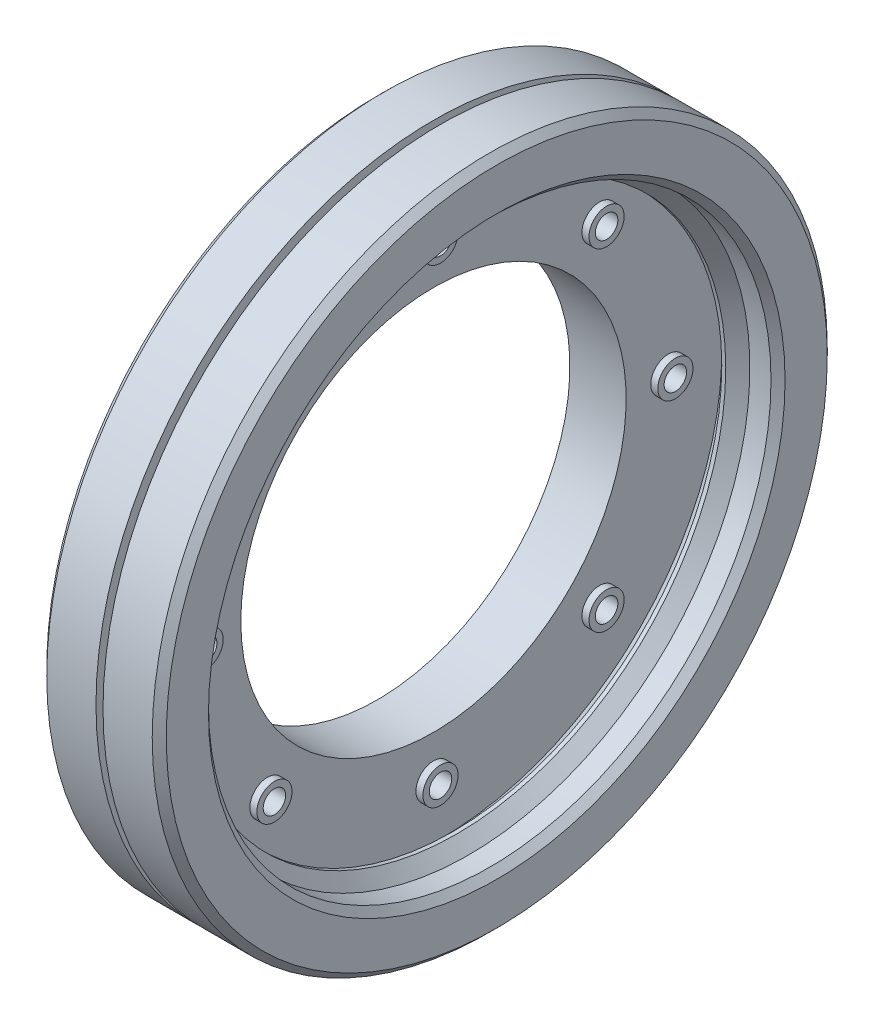
ISO-10303-21;
HEADER;
FILE_DESCRIPTION(('STEP AP214'),'2;1');
FILE_NAME('part.step','',(''),(''),'','','');
FILE_SCHEMA(('AUTOMOTIVE_DESIGN { 1 0 10303 214 1 1 1 1 }'));
ENDSEC;
DATA;
#1=APPLICATION_CONTEXT('core data for automotive mechanical design processes');
#2=APPLICATION_PROTOCOL_DEFINITION('international standard','automotive_design',2000,#1);
#3=PRODUCT_CONTEXT('',#1,'mechanical');
#4=PRODUCT('Part','Part','',(#3));
#5=PRODUCT_RELATED_PRODUCT_CATEGORY('part','',(#4));
#6=PRODUCT_DEFINITION_FORMATION('','',#4);
#7=PRODUCT_DEFINITION_CONTEXT('part definition',#1,'design');
#8=PRODUCT_DEFINITION('design','',#6,#7);
#9=PRODUCT_DEFINITION_SHAPE('','',#8);
#10=(LENGTH_UNIT() NAMED_UNIT(*) SI_UNIT(.MILLI.,.METRE.));
#11=(NAMED_UNIT(*) PLANE_ANGLE_UNIT() SI_UNIT($,.RADIAN.));
#12=(NAMED_UNIT(*) SI_UNIT($,.STERADIAN.) SOLID_ANGLE_UNIT());
#13=UNCERTAINTY_MEASURE_WITH_UNIT(LENGTH_MEASURE(1.E-05),#10,'distance_accuracy_value','');
#14=(GEOMETRIC_REPRESENTATION_CONTEXT(3) GLOBAL_UNCERTAINTY_ASSIGNED_CONTEXT((#13)) GLOBAL_UNIT_ASSIGNED_CONTEXT((#10,
#11,#12)) REPRESENTATION_CONTEXT('',''));
#15=CARTESIAN_POINT('',(0.,0.,0.));
#16=DIRECTION('',(0.,0.,1.));
#17=DIRECTION('',(1.,0.,0.));
#18=AXIS2_PLACEMENT_3D('',#15,#16,#17);
#19=CARTESIAN_POINT('',(-0.999999999999999,0.,0.));
#20=DIRECTION('',(1.,0.,0.));
#21=DIRECTION('',(0.,0.,-1.));
#22=AXIS2_PLACEMENT_3D('',#19,#20,#21);
#23=PLANE('',#22);
#24=CARTESIAN_POINT('',(-0.999999999999999,33.4,-3.49846430152082E-13));
#25=DIRECTION('',(1.,0.,0.));
#26=DIRECTION('',(0.,1.,0.));
#27=AXIS2_PLACEMENT_3D('',#24,#25,#26);
#28=CIRCLE('',#27,2.5);
#29=CARTESIAN_POINT('',(-0.999999999999999,35.9,-3.76032540193405E-13));
#30=VERTEX_POINT('',#29);
#31=EDGE_CURVE('E182',#30,#30,#28,.T.);
#32=ORIENTED_EDGE('',*,*,#31,.F.);
#33=EDGE_LOOP('',(#32));
#34=FACE_BOUND('',#33,.T.);
#35=CARTESIAN_POINT('',(-0.999999999999999,0.,33.4));
#36=DIRECTION('',(1.,0.,0.));
#37=DIRECTION('',(0.,0.,1.));
#38=AXIS2_PLACEMENT_3D('',#35,#36,#37);
#39=CIRCLE('',#38,2.5);
#40=CARTESIAN_POINT('',(-0.999999999999999,0.,35.9));
#41=VERTEX_POINT('',#40);
#42=EDGE_CURVE('E158',#41,#41,#39,.T.);
#43=ORIENTED_EDGE('',*,*,#42,.F.);
#44=EDGE_LOOP('',(#43));
#45=FACE_BOUND('',#44,.T.);
#46=CARTESIAN_POINT('',(-0.999999999999999,-33.4,1.16615476717361E-13));
#47=DIRECTION('',(1.,0.,0.));
#48=DIRECTION('',(0.,-1.,0.));
#49=AXIS2_PLACEMENT_3D('',#46,#47,#48);
#50=CIRCLE('',#49,2.5);
#51=CARTESIAN_POINT('',(-0.999999999999999,-35.9,1.25344180064468E-13));
#52=VERTEX_POINT('',#51);
#53=EDGE_CURVE('E134',#52,#52,#50,.T.);
#54=ORIENTED_EDGE('',*,*,#53,.F.);
#55=EDGE_LOOP('',(#54));
#56=FACE_BOUND('',#55,.T.);
#57=CARTESIAN_POINT('',(-0.999999999999999,0.,-33.4));
#58=DIRECTION('',(1.,0.,0.));
#59=DIRECTION('',(0.,0.,-1.));
#60=AXIS2_PLACEMENT_3D('',#57,#58,#59);
#61=CIRCLE('',#60,2.5);
#62=CARTESIAN_POINT('',(-0.999999999999999,0.,-35.9));
#63=VERTEX_POINT('',#62);
#64=EDGE_CURVE('E112',#63,#63,#61,.T.);
#65=ORIENTED_EDGE('',*,*,#64,.F.);
#66=EDGE_LOOP('',(#65));
#67=FACE_BOUND('',#66,.T.);
#68=CARTESIAN_POINT('',(-0.999999999999997,0.,0.));
#69=DIRECTION('',(-1.,0.,0.));
#70=DIRECTION('',(0.,0.,1.));
#71=AXIS2_PLACEMENT_3D('',#68,#69,#70);
#72=CIRCLE('',#71,27.4);
#73=CARTESIAN_POINT('',(-0.999999999999997,0.,27.4));
#74=VERTEX_POINT('',#73);
#75=EDGE_CURVE('E67',#74,#74,#72,.T.);
#76=ORIENTED_EDGE('',*,*,#75,.T.);
#77=EDGE_LOOP('',(#76));
#78=FACE_BOUND('',#77,.T.);
#79=CARTESIAN_POINT('',(-1.,0.,0.));
#80=DIRECTION('',(-1.,0.,0.));
#81=DIRECTION('',(0.,0.,1.));
#82=AXIS2_PLACEMENT_3D('',#79,#80,#81);
#83=CIRCLE('',#82,48.);
#84=CARTESIAN_POINT('',(-1.,0.,48.));
#85=VERTEX_POINT('',#84);
#86=EDGE_CURVE('E103',#85,#85,#83,.T.);
#87=ORIENTED_EDGE('',*,*,#86,.F.);
#88=EDGE_LOOP('',(#87));
#89=FACE_BOUND('',#88,.T.);
#90=CARTESIAN_POINT('',(-0.999999999999999,-23.6173664916307,-23.6173664916306));
#91=DIRECTION('',(1.,0.,0.));
#92=DIRECTION('',(0.,-0.707106781186549,-0.707106781186546));
#93=AXIS2_PLACEMENT_3D('',#90,#91,#92);
#94=CIRCLE('',#93,2.5);
#95=CARTESIAN_POINT('',(-0.999999999999999,-25.3851334445971,-25.385133444597));
#96=VERTEX_POINT('',#95);
#97=EDGE_CURVE('E122',#96,#96,#94,.T.);
#98=ORIENTED_EDGE('',*,*,#97,.F.);
#99=EDGE_LOOP('',(#98));
#100=FACE_BOUND('',#99,.T.);
#101=CARTESIAN_POINT('',(-0.999999999999999,-23.6173664916306,23.6173664916308));
#102=DIRECTION('',(1.,0.,0.));
#103=DIRECTION('',(0.,-0.707106781186544,0.707106781186551));
#104=AXIS2_PLACEMENT_3D('',#101,#102,#103);
#105=CIRCLE('',#104,2.5);
#106=CARTESIAN_POINT('',(-0.999999999999999,-25.3851334445969,25.3851334445972));
#107=VERTEX_POINT('',#106);
#108=EDGE_CURVE('E146',#107,#107,#105,.T.);
#109=ORIENTED_EDGE('',*,*,#108,.F.);
#110=EDGE_LOOP('',(#109));
#111=FACE_BOUND('',#110,.T.);
#112=CARTESIAN_POINT('',(-0.999999999999999,23.6173664916309,23.6173664916305));
#113=DIRECTION('',(1.,0.,0.));
#114=DIRECTION('',(0.,0.707106781186554,0.707106781186541));
#115=AXIS2_PLACEMENT_3D('',#112,#113,#114);
#116=CIRCLE('',#115,2.5);
#117=CARTESIAN_POINT('',(-0.999999999999999,25.3851334445973,25.3851334445968));
#118=VERTEX_POINT('',#117);
#119=EDGE_CURVE('E170',#118,#118,#116,.T.);
#120=ORIENTED_EDGE('',*,*,#119,.F.);
#121=EDGE_LOOP('',(#120));
#122=FACE_BOUND('',#121,.T.);
#123=CARTESIAN_POINT('',(-0.999999999999999,23.6173664916304,-23.617366491631));
#124=DIRECTION('',(1.,0.,0.));
#125=DIRECTION('',(0.,0.707106781186539,-0.707106781186556));
#126=AXIS2_PLACEMENT_3D('',#123,#124,#125);
#127=CIRCLE('',#126,2.5);
#128=CARTESIAN_POINT('',(-0.999999999999999,25.3851334445968,-25.3851334445974));
#129=VERTEX_POINT('',#128);
#130=EDGE_CURVE('E194',#129,#129,#127,.T.);
#131=ORIENTED_EDGE('',*,*,#130,.F.);
#132=EDGE_LOOP('',(#131));
#133=FACE_BOUND('',#132,.T.);
#134=ADVANCED_FACE('F49',(#34,#45,#56,#67,#78,#89,#100,#111,#122,#133),#23,.T.);
#135=CARTESIAN_POINT('',(0.,0.,0.));
#136=DIRECTION('',(-1.,0.,0.));
#137=DIRECTION('',(0.,0.,1.));
#138=AXIS2_PLACEMENT_3D('',#135,#136,#137);
#139=CYLINDRICAL_SURFACE('',#138,48.);
#140=CARTESIAN_POINT('',(-7.99999999999998,0.,0.));
#141=DIRECTION('',(1.,0.,0.));
#142=DIRECTION('',(0.,0.,-1.));
#143=AXIS2_PLACEMENT_3D('',#140,#141,#142);
#144=CIRCLE('',#143,48.);
#145=CARTESIAN_POINT('',(-7.99999999999998,0.,-48.));
#146=VERTEX_POINT('',#145);
#147=EDGE_CURVE('E11',#146,#146,#144,.T.);
#148=ORIENTED_EDGE('',*,*,#147,.T.);
#149=EDGE_LOOP('',(#148));
#150=FACE_BOUND('',#149,.T.);
#151=ORIENTED_EDGE('',*,*,#86,.T.);
#152=EDGE_LOOP('',(#151));
#153=FACE_BOUND('',#152,.T.);
#154=ADVANCED_FACE('F224',(#150,#153),#139,.T.);
#155=CARTESIAN_POINT('',(-9.,0.,0.));
#156=DIRECTION('',(1.,0.,0.));
#157=DIRECTION('',(0.,0.,-1.));
#158=AXIS2_PLACEMENT_3D('',#155,#156,#157);
#159=PLANE('',#158);
#160=CARTESIAN_POINT('',(-9.,0.,0.));
#161=DIRECTION('',(1.,0.,0.));
#162=DIRECTION('',(0.,0.,-1.));
#163=AXIS2_PLACEMENT_3D('',#160,#161,#162);
#164=CIRCLE('',#163,47.);
#165=CARTESIAN_POINT('',(-9.,0.,-47.));
#166=VERTEX_POINT('',#165);
#167=EDGE_CURVE('E57',#166,#166,#164,.F.);
#168=ORIENTED_EDGE('',*,*,#167,.T.);
#169=EDGE_LOOP('',(#168));
#170=FACE_BOUND('',#169,.T.);
#171=CARTESIAN_POINT('',(-9.,-33.4,1.16615476717361E-13));
#172=DIRECTION('',(1.,0.,0.));
#173=DIRECTION('',(0.,0.,-1.));
#174=AXIS2_PLACEMENT_3D('',#171,#172,#173);
#175=CIRCLE('',#174,1.6);
#176=CARTESIAN_POINT('',(-9.,-33.4,-1.59999999999988));
#177=VERTEX_POINT('',#176);
#178=EDGE_CURVE('E70',#177,#177,#175,.T.);
#179=ORIENTED_EDGE('',*,*,#178,.T.);
#180=EDGE_LOOP('',(#179));
#181=FACE_BOUND('',#180,.T.);
#182=CARTESIAN_POINT('',(-9.,-23.6173664916306,23.6173664916308));
#183=DIRECTION('',(1.,0.,0.));
#184=DIRECTION('',(0.,0.,-1.));
#185=AXIS2_PLACEMENT_3D('',#182,#183,#184);
#186=CIRCLE('',#185,1.6);
#187=CARTESIAN_POINT('',(-9.,-23.6173664916306,22.0173664916308));
#188=VERTEX_POINT('',#187);
#189=EDGE_CURVE('E75',#188,#188,#186,.T.);
#190=ORIENTED_EDGE('',*,*,#189,.T.);
#191=EDGE_LOOP('',(#190));
#192=FACE_BOUND('',#191,.T.);
#193=CARTESIAN_POINT('',(-9.,0.,33.4));
#194=DIRECTION('',(1.,0.,0.));
#195=DIRECTION('',(0.,0.,-1.));
#196=AXIS2_PLACEMENT_3D('',#193,#194,#195);
#197=CIRCLE('',#196,1.6);
#198=CARTESIAN_POINT('',(-9.,0.,31.8));
#199=VERTEX_POINT('',#198);
#200=EDGE_CURVE('E79',#199,#199,#197,.T.);
#201=ORIENTED_EDGE('',*,*,#200,.T.);
#202=EDGE_LOOP('',(#201));
#203=FACE_BOUND('',#202,.T.);
#204=CARTESIAN_POINT('',(-9.,23.6173664916309,23.6173664916305));
#205=DIRECTION('',(1.,0.,0.));
#206=DIRECTION('',(0.,0.,-1.));
#207=AXIS2_PLACEMENT_3D('',#204,#205,#206);
#208=CIRCLE('',#207,1.6);
#209=CARTESIAN_POINT('',(-9.,23.6173664916309,22.0173664916305));
#210=VERTEX_POINT('',#209);
#211=EDGE_CURVE('E83',#210,#210,#208,.T.);
#212=ORIENTED_EDGE('',*,*,#211,.T.);
#213=EDGE_LOOP('',(#212));
#214=FACE_BOUND('',#213,.T.);
#215=CARTESIAN_POINT('',(-9.,33.4,-3.49846430152082E-13));
#216=DIRECTION('',(1.,0.,0.));
#217=DIRECTION('',(0.,0.,-1.));
#218=AXIS2_PLACEMENT_3D('',#215,#216,#217);
#219=CIRCLE('',#218,1.6);
#220=CARTESIAN_POINT('',(-9.,33.4,-1.60000000000035));
#221=VERTEX_POINT('',#220);
#222=EDGE_CURVE('E87',#221,#221,#219,.T.);
#223=ORIENTED_EDGE('',*,*,#222,.T.);
#224=EDGE_LOOP('',(#223));
#225=FACE_BOUND('',#224,.T.);
#226=CARTESIAN_POINT('',(-9.,23.6173664916304,-23.617366491631));
#227=DIRECTION('',(1.,0.,0.));
#228=DIRECTION('',(0.,0.,-1.));
#229=AXIS2_PLACEMENT_3D('',#226,#227,#228);
#230=CIRCLE('',#229,1.6);
#231=CARTESIAN_POINT('',(-9.,23.6173664916304,-25.217366491631));
#232=VERTEX_POINT('',#231);
#233=EDGE_CURVE('E91',#232,#232,#230,.T.);
#234=ORIENTED_EDGE('',*,*,#233,.T.);
#235=EDGE_LOOP('',(#234));
#236=FACE_BOUND('',#235,.T.);
#237=CARTESIAN_POINT('',(-9.,-23.6173664916307,-23.6173664916306));
#238=DIRECTION('',(1.,0.,0.));
#239=DIRECTION('',(0.,0.,-1.));
#240=AXIS2_PLACEMENT_3D('',#237,#238,#239);
#241=CIRCLE('',#240,1.6);
#242=CARTESIAN_POINT('',(-9.,-23.6173664916307,-25.2173664916306));
#243=VERTEX_POINT('',#242);
#244=EDGE_CURVE('E95',#243,#243,#241,.T.);
#245=ORIENTED_EDGE('',*,*,#244,.T.);
#246=EDGE_LOOP('',(#245));
#247=FACE_BOUND('',#246,.T.);
#248=CARTESIAN_POINT('',(-9.,0.,-33.4));
#249=DIRECTION('',(1.,0.,0.));
#250=DIRECTION('',(0.,0.,-1.));
#251=AXIS2_PLACEMENT_3D('',#248,#249,#250);
#252=CIRCLE('',#251,1.6);
#253=CARTESIAN_POINT('',(-9.,0.,-35.));
#254=VERTEX_POINT('',#253);
#255=EDGE_CURVE('E107',#254,#254,#252,.T.);
#256=ORIENTED_EDGE('',*,*,#255,.T.);
#257=EDGE_LOOP('',(#256));
#258=FACE_BOUND('',#257,.T.);
#259=CARTESIAN_POINT('',(-9.,0.,0.));
#260=DIRECTION('',(-1.,0.,0.));
#261=DIRECTION('',(0.,0.,1.));
#262=AXIS2_PLACEMENT_3D('',#259,#260,#261);
#263=CIRCLE('',#262,27.4);
#264=CARTESIAN_POINT('',(-9.,0.,27.4));
#265=VERTEX_POINT('',#264);
#266=EDGE_CURVE('E62',#265,#265,#263,.T.);
#267=ORIENTED_EDGE('',*,*,#266,.F.);
#268=EDGE_LOOP('',(#267));
#269=FACE_BOUND('',#268,.T.);
#270=ADVANCED_FACE('F230',(#170,#181,#192,#203,#214,#225,#236,#247,#258,#269),#159,.F.);
#271=CARTESIAN_POINT('',(0.,0.,0.));
#272=DIRECTION('',(-1.,0.,0.));
#273=DIRECTION('',(0.,0.,1.));
#274=AXIS2_PLACEMENT_3D('',#271,#272,#273);
#275=CYLINDRICAL_SURFACE('',#274,27.4);
#276=ORIENTED_EDGE('',*,*,#266,.T.);
#277=EDGE_LOOP('',(#276));
#278=FACE_BOUND('',#277,.T.);
#279=ORIENTED_EDGE('',*,*,#75,.F.);
#280=EDGE_LOOP('',(#279));
#281=FACE_BOUND('',#280,.T.);
#282=ADVANCED_FACE('F237',(#278,#281),#275,.F.);
#283=CARTESIAN_POINT('',(-11.,0.,-33.4));
#284=DIRECTION('',(1.,0.,0.));
#285=DIRECTION('',(0.,0.,-1.));
#286=AXIS2_PLACEMENT_3D('',#283,#284,#285);
#287=CYLINDRICAL_SURFACE('',#286,1.6);
#288=ORIENTED_EDGE('',*,*,#255,.F.);
#289=EDGE_LOOP('',(#288));
#290=FACE_BOUND('',#289,.T.);
#291=CARTESIAN_POINT('',(0.,0.,-33.4));
#292=DIRECTION('',(1.,0.,0.));
#293=DIRECTION('',(0.,0.,-1.));
#294=AXIS2_PLACEMENT_3D('',#291,#292,#293);
#295=CIRCLE('',#294,1.6);
#296=CARTESIAN_POINT('',(0.,0.,-35.));
#297=VERTEX_POINT('',#296);
#298=EDGE_CURVE('E74',#297,#297,#295,.T.);
#299=ORIENTED_EDGE('',*,*,#298,.T.);
#300=EDGE_LOOP('',(#299));
#301=FACE_BOUND('',#300,.T.);
#302=ADVANCED_FACE('F235',(#290,#301),#287,.F.);
#303=CARTESIAN_POINT('',(0.,0.,-33.4));
#304=DIRECTION('',(1.,0.,0.));
#305=DIRECTION('',(0.,0.,-1.));
#306=AXIS2_PLACEMENT_3D('',#303,#304,#305);
#307=PLANE('',#306);
#308=CARTESIAN_POINT('',(0.,0.,-33.4));
#309=DIRECTION('',(1.,0.,0.));
#310=DIRECTION('',(0.,0.,-1.));
#311=AXIS2_PLACEMENT_3D('',#308,#309,#310);
#312=CIRCLE('',#311,2.5);
#313=CARTESIAN_POINT('',(0.,0.,-35.9));
#314=VERTEX_POINT('',#313);
#315=EDGE_CURVE('E111',#314,#314,#312,.T.);
#316=ORIENTED_EDGE('',*,*,#315,.T.);
#317=EDGE_LOOP('',(#316));
#318=FACE_BOUND('',#317,.T.);
#319=ORIENTED_EDGE('',*,*,#298,.F.);
#320=EDGE_LOOP('',(#319));
#321=FACE_BOUND('',#320,.T.);
#322=ADVANCED_FACE('F352',(#318,#321),#307,.T.);
#323=CARTESIAN_POINT('',(0.,0.,-33.4));
#324=DIRECTION('',(-1.,0.,0.));
#325=DIRECTION('',(0.,0.,1.));
#326=AXIS2_PLACEMENT_3D('',#323,#324,#325);
#327=CYLINDRICAL_SURFACE('',#326,2.5);
#328=ORIENTED_EDGE('',*,*,#315,.F.);
#329=EDGE_LOOP('',(#328));
#330=FACE_BOUND('',#329,.T.);
#331=ORIENTED_EDGE('',*,*,#64,.T.);
#332=EDGE_LOOP('',(#331));
#333=FACE_BOUND('',#332,.T.);
#334=ADVANCED_FACE('F350',(#330,#333),#327,.T.);
#335=CARTESIAN_POINT('',(-11.,-23.6173664916307,-23.6173664916306));
#336=DIRECTION('',(1.,0.,0.));
#337=DIRECTION('',(0.,0.,-1.));
#338=AXIS2_PLACEMENT_3D('',#335,#336,#337);
#339=CYLINDRICAL_SURFACE('',#338,1.6);
#340=ORIENTED_EDGE('',*,*,#244,.F.);
#341=EDGE_LOOP('',(#340));
#342=FACE_BOUND('',#341,.T.);
#343=CARTESIAN_POINT('',(0.,-23.6173664916307,-23.6173664916306));
#344=DIRECTION('',(1.,0.,0.));
#345=DIRECTION('',(0.,-0.707106781186549,-0.707106781186546));
#346=AXIS2_PLACEMENT_3D('',#343,#344,#345);
#347=CIRCLE('',#346,1.6);
#348=CARTESIAN_POINT('',(0.,-24.7487373415292,-24.7487373415291));
#349=VERTEX_POINT('',#348);
#350=EDGE_CURVE('E126',#349,#349,#347,.T.);
#351=ORIENTED_EDGE('',*,*,#350,.T.);
#352=EDGE_LOOP('',(#351));
#353=FACE_BOUND('',#352,.T.);
#354=ADVANCED_FACE('F332',(#342,#353),#339,.F.);
#355=CARTESIAN_POINT('',(-11.,23.6173664916304,-23.617366491631));
#356=DIRECTION('',(1.,0.,0.));
#357=DIRECTION('',(0.,0.,-1.));
#358=AXIS2_PLACEMENT_3D('',#355,#356,#357);
#359=CYLINDRICAL_SURFACE('',#358,1.6);
#360=ORIENTED_EDGE('',*,*,#233,.F.);
#361=EDGE_LOOP('',(#360));
#362=FACE_BOUND('',#361,.T.);
#363=CARTESIAN_POINT('',(0.,23.6173664916304,-23.617366491631));
#364=DIRECTION('',(1.,0.,0.));
#365=DIRECTION('',(0.,0.707106781186539,-0.707106781186556));
#366=AXIS2_PLACEMENT_3D('',#363,#364,#365);
#367=CIRCLE('',#366,1.6);
#368=CARTESIAN_POINT('',(0.,24.7487373415289,-24.7487373415295));
#369=VERTEX_POINT('',#368);
#370=EDGE_CURVE('E198',#369,#369,#367,.T.);
#371=ORIENTED_EDGE('',*,*,#370,.T.);
#372=EDGE_LOOP('',(#371));
#373=FACE_BOUND('',#372,.T.);
#374=ADVANCED_FACE('F206',(#362,#373),#359,.F.);
#375=CARTESIAN_POINT('',(-11.,33.4,-3.49846430152082E-13));
#376=DIRECTION('',(1.,0.,0.));
#377=DIRECTION('',(0.,0.,-1.));
#378=AXIS2_PLACEMENT_3D('',#375,#376,#377);
#379=CYLINDRICAL_SURFACE('',#378,1.6);
#380=ORIENTED_EDGE('',*,*,#222,.F.);
#381=EDGE_LOOP('',(#380));
#382=FACE_BOUND('',#381,.T.);
#383=CARTESIAN_POINT('',(0.,33.4,-3.49846430152082E-13));
#384=DIRECTION('',(1.,0.,0.));
#385=DIRECTION('',(0.,1.,0.));
#386=AXIS2_PLACEMENT_3D('',#383,#384,#385);
#387=CIRCLE('',#386,1.6);
#388=CARTESIAN_POINT('',(0.,35.,-3.66605540578529E-13));
#389=VERTEX_POINT('',#388);
#390=EDGE_CURVE('E186',#389,#389,#387,.T.);
#391=ORIENTED_EDGE('',*,*,#390,.T.);
#392=EDGE_LOOP('',(#391));
#393=FACE_BOUND('',#392,.T.);
#394=ADVANCED_FACE('F325',(#382,#393),#379,.F.);
#395=CARTESIAN_POINT('',(-11.,23.6173664916309,23.6173664916305));
#396=DIRECTION('',(1.,0.,0.));
#397=DIRECTION('',(0.,0.,-1.));
#398=AXIS2_PLACEMENT_3D('',#395,#396,#397);
#399=CYLINDRICAL_SURFACE('',#398,1.6);
#400=ORIENTED_EDGE('',*,*,#211,.F.);
#401=EDGE_LOOP('',(#400));
#402=FACE_BOUND('',#401,.T.);
#403=CARTESIAN_POINT('',(0.,23.6173664916309,23.6173664916305));
#404=DIRECTION('',(1.,0.,0.));
#405=DIRECTION('',(0.,0.707106781186554,0.707106781186541));
#406=AXIS2_PLACEMENT_3D('',#403,#404,#405);
#407=CIRCLE('',#406,1.6);
#408=CARTESIAN_POINT('',(0.,24.7487373415294,24.7487373415289));
#409=VERTEX_POINT('',#408);
#410=EDGE_CURVE('E174',#409,#409,#407,.T.);
#411=ORIENTED_EDGE('',*,*,#410,.T.);
#412=EDGE_LOOP('',(#411));
#413=FACE_BOUND('',#412,.T.);
#414=ADVANCED_FACE('F328',(#402,#413),#399,.F.);
#415=CARTESIAN_POINT('',(-11.,0.,33.4));
#416=DIRECTION('',(1.,0.,0.));
#417=DIRECTION('',(0.,0.,-1.));
#418=AXIS2_PLACEMENT_3D('',#415,#416,#417);
#419=CYLINDRICAL_SURFACE('',#418,1.6);
#420=ORIENTED_EDGE('',*,*,#200,.F.);
#421=EDGE_LOOP('',(#420));
#422=FACE_BOUND('',#421,.T.);
#423=CARTESIAN_POINT('',(0.,0.,33.4));
#424=DIRECTION('',(1.,0.,0.));
#425=DIRECTION('',(0.,0.,1.));
#426=AXIS2_PLACEMENT_3D('',#423,#424,#425);
#427=CIRCLE('',#426,1.6);
#428=CARTESIAN_POINT('',(0.,0.,35.));
#429=VERTEX_POINT('',#428);
#430=EDGE_CURVE('E162',#429,#429,#427,.T.);
#431=ORIENTED_EDGE('',*,*,#430,.T.);
#432=EDGE_LOOP('',(#431));
#433=FACE_BOUND('',#432,.T.);
#434=ADVANCED_FACE('F340',(#422,#433),#419,.F.);
#435=CARTESIAN_POINT('',(-11.,-23.6173664916306,23.6173664916308));
#436=DIRECTION('',(1.,0.,0.));
#437=DIRECTION('',(0.,0.,-1.));
#438=AXIS2_PLACEMENT_3D('',#435,#436,#437);
#439=CYLINDRICAL_SURFACE('',#438,1.6);
#440=ORIENTED_EDGE('',*,*,#189,.F.);
#441=EDGE_LOOP('',(#440));
#442=FACE_BOUND('',#441,.T.);
#443=CARTESIAN_POINT('',(0.,-23.6173664916306,23.6173664916308));
#444=DIRECTION('',(1.,0.,0.));
#445=DIRECTION('',(0.,-0.707106781186544,0.707106781186551));
#446=AXIS2_PLACEMENT_3D('',#443,#444,#445);
#447=CIRCLE('',#446,1.6);
#448=CARTESIAN_POINT('',(0.,-24.748737341529,24.7487373415293));
#449=VERTEX_POINT('',#448);
#450=EDGE_CURVE('E150',#449,#449,#447,.T.);
#451=ORIENTED_EDGE('',*,*,#450,.T.);
#452=EDGE_LOOP('',(#451));
#453=FACE_BOUND('',#452,.T.);
#454=ADVANCED_FACE('F336',(#442,#453),#439,.F.);
#455=CARTESIAN_POINT('',(-11.,-33.4,1.16615476717361E-13));
#456=DIRECTION('',(1.,0.,0.));
#457=DIRECTION('',(0.,0.,-1.));
#458=AXIS2_PLACEMENT_3D('',#455,#456,#457);
#459=CYLINDRICAL_SURFACE('',#458,1.6);
#460=ORIENTED_EDGE('',*,*,#178,.F.);
#461=EDGE_LOOP('',(#460));
#462=FACE_BOUND('',#461,.T.);
#463=CARTESIAN_POINT('',(0.,-33.4,1.16615476717361E-13));
#464=DIRECTION('',(1.,0.,0.));
#465=DIRECTION('',(0.,-1.,0.));
#466=AXIS2_PLACEMENT_3D('',#463,#464,#465);
#467=CIRCLE('',#466,1.6);
#468=CARTESIAN_POINT('',(0.,-35.,1.2220184685951E-13));
#469=VERTEX_POINT('',#468);
#470=EDGE_CURVE('E138',#469,#469,#467,.T.);
#471=ORIENTED_EDGE('',*,*,#470,.T.);
#472=EDGE_LOOP('',(#471));
#473=FACE_BOUND('',#472,.T.);
#474=ADVANCED_FACE('F320',(#462,#473),#459,.F.);
#475=CARTESIAN_POINT('',(0.,-23.6173664916307,-23.6173664916306));
#476=DIRECTION('',(1.,0.,0.));
#477=DIRECTION('',(0.,-0.707106781186549,-0.707106781186546));
#478=AXIS2_PLACEMENT_3D('',#475,#476,#477);
#479=PLANE('',#478);
#480=CARTESIAN_POINT('',(0.,-23.6173664916307,-23.6173664916306));
#481=DIRECTION('',(1.,0.,0.));
#482=DIRECTION('',(0.,-0.707106781186549,-0.707106781186546));
#483=AXIS2_PLACEMENT_3D('',#480,#481,#482);
#484=CIRCLE('',#483,2.5);
#485=CARTESIAN_POINT('',(0.,-25.3851334445971,-25.385133444597));
#486=VERTEX_POINT('',#485);
#487=EDGE_CURVE('E98',#486,#486,#484,.T.);
#488=ORIENTED_EDGE('',*,*,#487,.T.);
#489=EDGE_LOOP('',(#488));
#490=FACE_BOUND('',#489,.T.);
#491=ORIENTED_EDGE('',*,*,#350,.F.);
#492=EDGE_LOOP('',(#491));
#493=FACE_BOUND('',#492,.T.);
#494=ADVANCED_FACE('F317',(#490,#493),#479,.T.);
#495=CARTESIAN_POINT('',(0.,-23.6173664916307,-23.6173664916306));
#496=DIRECTION('',(-1.,0.,0.));
#497=DIRECTION('',(0.,0.,1.));
#498=AXIS2_PLACEMENT_3D('',#495,#496,#497);
#499=CYLINDRICAL_SURFACE('',#498,2.5);
#500=ORIENTED_EDGE('',*,*,#487,.F.);
#501=EDGE_LOOP('',(#500));
#502=FACE_BOUND('',#501,.T.);
#503=ORIENTED_EDGE('',*,*,#97,.T.);
#504=EDGE_LOOP('',(#503));
#505=FACE_BOUND('',#504,.T.);
#506=ADVANCED_FACE('F312',(#502,#505),#499,.T.);
#507=CARTESIAN_POINT('',(0.,-33.4,1.16615476717361E-13));
#508=DIRECTION('',(1.,0.,0.));
#509=DIRECTION('',(0.,-1.,0.));
#510=AXIS2_PLACEMENT_3D('',#507,#508,#509);
#511=PLANE('',#510);
#512=CARTESIAN_POINT('',(0.,-33.4,1.16615476717361E-13));
#513=DIRECTION('',(1.,0.,0.));
#514=DIRECTION('',(0.,-1.,0.));
#515=AXIS2_PLACEMENT_3D('',#512,#513,#514);
#516=CIRCLE('',#515,2.5);
#517=CARTESIAN_POINT('',(0.,-35.9,1.25344180064468E-13));
#518=VERTEX_POINT('',#517);
#519=EDGE_CURVE('E133',#518,#518,#516,.T.);
#520=ORIENTED_EDGE('',*,*,#519,.T.);
#521=EDGE_LOOP('',(#520));
#522=FACE_BOUND('',#521,.T.);
#523=ORIENTED_EDGE('',*,*,#470,.F.);
#524=EDGE_LOOP('',(#523));
#525=FACE_BOUND('',#524,.T.);
#526=ADVANCED_FACE('F309',(#522,#525),#511,.T.);
#527=CARTESIAN_POINT('',(0.,-33.4,1.16615476717361E-13));
#528=DIRECTION('',(-1.,0.,0.));
#529=DIRECTION('',(0.,0.,1.));
#530=AXIS2_PLACEMENT_3D('',#527,#528,#529);
#531=CYLINDRICAL_SURFACE('',#530,2.5);
#532=ORIENTED_EDGE('',*,*,#519,.F.);
#533=EDGE_LOOP('',(#532));
#534=FACE_BOUND('',#533,.T.);
#535=ORIENTED_EDGE('',*,*,#53,.T.);
#536=EDGE_LOOP('',(#535));
#537=FACE_BOUND('',#536,.T.);
#538=ADVANCED_FACE('F304',(#534,#537),#531,.T.);
#539=CARTESIAN_POINT('',(0.,-23.6173664916306,23.6173664916308));
#540=DIRECTION('',(1.,0.,0.));
#541=DIRECTION('',(0.,-0.707106781186544,0.707106781186551));
#542=AXIS2_PLACEMENT_3D('',#539,#540,#541);
#543=PLANE('',#542);
#544=CARTESIAN_POINT('',(0.,-23.6173664916306,23.6173664916308));
#545=DIRECTION('',(1.,0.,0.));
#546=DIRECTION('',(0.,-0.707106781186544,0.707106781186551));
#547=AXIS2_PLACEMENT_3D('',#544,#545,#546);
#548=CIRCLE('',#547,2.5);
#549=CARTESIAN_POINT('',(0.,-25.3851334445969,25.3851334445972));
#550=VERTEX_POINT('',#549);
#551=EDGE_CURVE('E145',#550,#550,#548,.T.);
#552=ORIENTED_EDGE('',*,*,#551,.T.);
#553=EDGE_LOOP('',(#552));
#554=FACE_BOUND('',#553,.T.);
#555=ORIENTED_EDGE('',*,*,#450,.F.);
#556=EDGE_LOOP('',(#555));
#557=FACE_BOUND('',#556,.T.);
#558=ADVANCED_FACE('F301',(#554,#557),#543,.T.);
#559=CARTESIAN_POINT('',(0.,-23.6173664916306,23.6173664916308));
#560=DIRECTION('',(-1.,0.,0.));
#561=DIRECTION('',(0.,0.,1.));
#562=AXIS2_PLACEMENT_3D('',#559,#560,#561);
#563=CYLINDRICAL_SURFACE('',#562,2.5);
#564=ORIENTED_EDGE('',*,*,#551,.F.);
#565=EDGE_LOOP('',(#564));
#566=FACE_BOUND('',#565,.T.);
#567=ORIENTED_EDGE('',*,*,#108,.T.);
#568=EDGE_LOOP('',(#567));
#569=FACE_BOUND('',#568,.T.);
#570=ADVANCED_FACE('F296',(#566,#569),#563,.T.);
#571=CARTESIAN_POINT('',(0.,0.,33.4));
#572=DIRECTION('',(1.,0.,0.));
#573=DIRECTION('',(0.,0.,1.));
#574=AXIS2_PLACEMENT_3D('',#571,#572,#573);
#575=PLANE('',#574);
#576=CARTESIAN_POINT('',(0.,0.,33.4));
#577=DIRECTION('',(1.,0.,0.));
#578=DIRECTION('',(0.,0.,1.));
#579=AXIS2_PLACEMENT_3D('',#576,#577,#578);
#580=CIRCLE('',#579,2.5);
#581=CARTESIAN_POINT('',(0.,0.,35.9));
#582=VERTEX_POINT('',#581);
#583=EDGE_CURVE('E157',#582,#582,#580,.T.);
#584=ORIENTED_EDGE('',*,*,#583,.T.);
#585=EDGE_LOOP('',(#584));
#586=FACE_BOUND('',#585,.T.);
#587=ORIENTED_EDGE('',*,*,#430,.F.);
#588=EDGE_LOOP('',(#587));
#589=FACE_BOUND('',#588,.T.);
#590=ADVANCED_FACE('F293',(#586,#589),#575,.T.);
#591=CARTESIAN_POINT('',(0.,0.,33.4));
#592=DIRECTION('',(-1.,0.,0.));
#593=DIRECTION('',(0.,0.,1.));
#594=AXIS2_PLACEMENT_3D('',#591,#592,#593);
#595=CYLINDRICAL_SURFACE('',#594,2.5);
#596=ORIENTED_EDGE('',*,*,#583,.F.);
#597=EDGE_LOOP('',(#596));
#598=FACE_BOUND('',#597,.T.);
#599=ORIENTED_EDGE('',*,*,#42,.T.);
#600=EDGE_LOOP('',(#599));
#601=FACE_BOUND('',#600,.T.);
#602=ADVANCED_FACE('F288',(#598,#601),#595,.T.);
#603=CARTESIAN_POINT('',(0.,23.6173664916309,23.6173664916305));
#604=DIRECTION('',(1.,0.,0.));
#605=DIRECTION('',(0.,0.707106781186554,0.707106781186541));
#606=AXIS2_PLACEMENT_3D('',#603,#604,#605);
#607=PLANE('',#606);
#608=CARTESIAN_POINT('',(0.,23.6173664916309,23.6173664916305));
#609=DIRECTION('',(1.,0.,0.));
#610=DIRECTION('',(0.,0.707106781186554,0.707106781186541));
#611=AXIS2_PLACEMENT_3D('',#608,#609,#610);
#612=CIRCLE('',#611,2.5);
#613=CARTESIAN_POINT('',(0.,25.3851334445973,25.3851334445968));
#614=VERTEX_POINT('',#613);
#615=EDGE_CURVE('E169',#614,#614,#612,.T.);
#616=ORIENTED_EDGE('',*,*,#615,.T.);
#617=EDGE_LOOP('',(#616));
#618=FACE_BOUND('',#617,.T.);
#619=ORIENTED_EDGE('',*,*,#410,.F.);
#620=EDGE_LOOP('',(#619));
#621=FACE_BOUND('',#620,.T.);
#622=ADVANCED_FACE('F279',(#618,#621),#607,.T.);
#623=CARTESIAN_POINT('',(0.,23.6173664916309,23.6173664916305));
#624=DIRECTION('',(-1.,0.,0.));
#625=DIRECTION('',(0.,0.,1.));
#626=AXIS2_PLACEMENT_3D('',#623,#624,#625);
#627=CYLINDRICAL_SURFACE('',#626,2.5);
#628=ORIENTED_EDGE('',*,*,#615,.F.);
#629=EDGE_LOOP('',(#628));
#630=FACE_BOUND('',#629,.T.);
#631=ORIENTED_EDGE('',*,*,#119,.T.);
#632=EDGE_LOOP('',(#631));
#633=FACE_BOUND('',#632,.T.);
#634=ADVANCED_FACE('F277',(#630,#633),#627,.T.);
#635=CARTESIAN_POINT('',(0.,33.4,-3.49846430152082E-13));
#636=DIRECTION('',(1.,0.,0.));
#637=DIRECTION('',(0.,1.,0.));
#638=AXIS2_PLACEMENT_3D('',#635,#636,#637);
#639=PLANE('',#638);
#640=CARTESIAN_POINT('',(0.,33.4,-3.49846430152082E-13));
#641=DIRECTION('',(1.,0.,0.));
#642=DIRECTION('',(0.,1.,0.));
#643=AXIS2_PLACEMENT_3D('',#640,#641,#642);
#644=CIRCLE('',#643,2.5);
#645=CARTESIAN_POINT('',(0.,35.9,-3.76032540193405E-13));
#646=VERTEX_POINT('',#645);
#647=EDGE_CURVE('E181',#646,#646,#644,.T.);
#648=ORIENTED_EDGE('',*,*,#647,.T.);
#649=EDGE_LOOP('',(#648));
#650=FACE_BOUND('',#649,.T.);
#651=ORIENTED_EDGE('',*,*,#390,.F.);
#652=EDGE_LOOP('',(#651));
#653=FACE_BOUND('',#652,.T.);
#654=ADVANCED_FACE('F220',(#650,#653),#639,.T.);
#655=CARTESIAN_POINT('',(0.,33.4,-3.49846430152082E-13));
#656=DIRECTION('',(-1.,0.,0.));
#657=DIRECTION('',(0.,0.,1.));
#658=AXIS2_PLACEMENT_3D('',#655,#656,#657);
#659=CYLINDRICAL_SURFACE('',#658,2.5);
#660=ORIENTED_EDGE('',*,*,#647,.F.);
#661=EDGE_LOOP('',(#660));
#662=FACE_BOUND('',#661,.T.);
#663=ORIENTED_EDGE('',*,*,#31,.T.);
#664=EDGE_LOOP('',(#663));
#665=FACE_BOUND('',#664,.T.);
#666=ADVANCED_FACE('F211',(#662,#665),#659,.T.);
#667=CARTESIAN_POINT('',(0.,23.6173664916304,-23.617366491631));
#668=DIRECTION('',(1.,0.,0.));
#669=DIRECTION('',(0.,0.707106781186539,-0.707106781186556));
#670=AXIS2_PLACEMENT_3D('',#667,#668,#669);
#671=PLANE('',#670);
#672=CARTESIAN_POINT('',(0.,23.6173664916304,-23.617366491631));
#673=DIRECTION('',(1.,0.,0.));
#674=DIRECTION('',(0.,0.707106781186539,-0.707106781186556));
#675=AXIS2_PLACEMENT_3D('',#672,#673,#674);
#676=CIRCLE('',#675,2.5);
#677=CARTESIAN_POINT('',(0.,25.3851334445968,-25.3851334445974));
#678=VERTEX_POINT('',#677);
#679=EDGE_CURVE('E193',#678,#678,#676,.T.);
#680=ORIENTED_EDGE('',*,*,#679,.T.);
#681=EDGE_LOOP('',(#680));
#682=FACE_BOUND('',#681,.T.);
#683=ORIENTED_EDGE('',*,*,#370,.F.);
#684=EDGE_LOOP('',(#683));
#685=FACE_BOUND('',#684,.T.);
#686=ADVANCED_FACE('F208',(#682,#685),#671,.T.);
#687=CARTESIAN_POINT('',(0.,23.6173664916304,-23.617366491631));
#688=DIRECTION('',(-1.,0.,0.));
#689=DIRECTION('',(0.,0.,1.));
#690=AXIS2_PLACEMENT_3D('',#687,#688,#689);
#691=CYLINDRICAL_SURFACE('',#690,2.5);
#692=ORIENTED_EDGE('',*,*,#679,.F.);
#693=EDGE_LOOP('',(#692));
#694=FACE_BOUND('',#693,.T.);
#695=ORIENTED_EDGE('',*,*,#130,.T.);
#696=EDGE_LOOP('',(#695));
#697=FACE_BOUND('',#696,.T.);
#698=ADVANCED_FACE('F210',(#694,#697),#691,.T.);
#699=CARTESIAN_POINT('',(-9.,0.,0.));
#700=DIRECTION('',(1.,0.,0.));
#701=DIRECTION('',(0.,0.,-1.));
#702=AXIS2_PLACEMENT_3D('',#699,#700,#701);
#703=CONICAL_SURFACE('',#702,47.,0.785398163397441);
#704=ORIENTED_EDGE('',*,*,#147,.F.);
#705=EDGE_LOOP('',(#704));
#706=FACE_BOUND('',#705,.T.);
#707=ORIENTED_EDGE('',*,*,#167,.F.);
#708=EDGE_LOOP('',(#707));
#709=FACE_BOUND('',#708,.T.);
#710=ADVANCED_FACE('F51',(#706,#709),#703,.T.);
#711=CLOSED_SHELL('',(#134,#154,#270,#282,#302,#322,#334,#354,#374,#394,#414,#434,#454,#474,
#494,#506,#526,#538,#558,#570,#590,#602,#622,#634,#654,#666,#686,#698,#710));
#712=MANIFOLD_SOLID_BREP('B2',#711);
#713=CARTESIAN_POINT('',(8.,0.,0.));
#714=DIRECTION('',(1.,0.,0.));
#715=DIRECTION('',(0.,0.,-1.));
#716=AXIS2_PLACEMENT_3D('',#713,#714,#715);
#717=PLANE('',#716);
#718=CARTESIAN_POINT('',(8.,0.,0.));
#719=DIRECTION('',(1.,0.,0.));
#720=DIRECTION('',(0.,0.,-1.));
#721=AXIS2_PLACEMENT_3D('',#718,#719,#720);
#722=CIRCLE('',#721,47.);
#723=CARTESIAN_POINT('',(8.,0.,-47.));
#724=VERTEX_POINT('',#723);
#725=EDGE_CURVE('E601',#724,#724,#722,.T.);
#726=ORIENTED_EDGE('',*,*,#725,.T.);
#727=EDGE_LOOP('',(#726));
#728=FACE_BOUND('',#727,.T.);
#729=CARTESIAN_POINT('',(8.,0.,0.));
#730=DIRECTION('',(1.,0.,0.));
#731=DIRECTION('',(0.,0.,-1.));
#732=AXIS2_PLACEMENT_3D('',#729,#730,#731);
#733=CIRCLE('',#732,41.);
#734=CARTESIAN_POINT('',(8.,0.,-41.));
#735=VERTEX_POINT('',#734);
#736=EDGE_CURVE('E605',#735,#735,#733,.F.);
#737=ORIENTED_EDGE('',*,*,#736,.T.);
#738=EDGE_LOOP('',(#737));
#739=FACE_BOUND('',#738,.T.);
#740=ADVANCED_FACE('F594',(#728,#739),#717,.T.);
#741=CARTESIAN_POINT('',(0.,0.,0.));
#742=DIRECTION('',(-1.,0.,0.));
#743=DIRECTION('',(0.,0.,1.));
#744=AXIS2_PLACEMENT_3D('',#741,#742,#743);
#745=CYLINDRICAL_SURFACE('',#744,48.);
#746=CARTESIAN_POINT('',(6.99999999999999,0.,0.));
#747=DIRECTION('',(1.,0.,0.));
#748=DIRECTION('',(0.,0.,-1.));
#749=AXIS2_PLACEMENT_3D('',#746,#747,#748);
#750=CIRCLE('',#749,48.);
#751=CARTESIAN_POINT('',(6.99999999999999,0.,-48.));
#752=VERTEX_POINT('',#751);
#753=EDGE_CURVE('E609',#752,#752,#750,.F.);
#754=ORIENTED_EDGE('',*,*,#753,.T.);
#755=EDGE_LOOP('',(#754));
#756=FACE_BOUND('',#755,.T.);
#757=CARTESIAN_POINT('',(0.,0.,0.));
#758=DIRECTION('',(-1.,0.,0.));
#759=DIRECTION('',(0.,0.,1.));
#760=AXIS2_PLACEMENT_3D('',#757,#758,#759);
#761=CIRCLE('',#760,48.);
#762=CARTESIAN_POINT('',(0.,0.,48.));
#763=VERTEX_POINT('',#762);
#764=EDGE_CURVE('E620',#763,#763,#761,.T.);
#765=ORIENTED_EDGE('',*,*,#764,.F.);
#766=EDGE_LOOP('',(#765));
#767=FACE_BOUND('',#766,.T.);
#768=ADVANCED_FACE('F647',(#756,#767),#745,.T.);
#769=CARTESIAN_POINT('',(0.,0.,0.));
#770=DIRECTION('',(1.,0.,0.));
#771=DIRECTION('',(0.,0.,-1.));
#772=AXIS2_PLACEMENT_3D('',#769,#770,#771);
#773=PLANE('',#772);
#774=CARTESIAN_POINT('',(0.,0.,0.));
#775=DIRECTION('',(-1.,0.,0.));
#776=DIRECTION('',(0.,0.,1.));
#777=AXIS2_PLACEMENT_3D('',#774,#775,#776);
#778=CIRCLE('',#777,40.);
#779=CARTESIAN_POINT('',(0.,0.,40.));
#780=VERTEX_POINT('',#779);
#781=EDGE_CURVE('E623',#780,#780,#778,.T.);
#782=ORIENTED_EDGE('',*,*,#781,.F.);
#783=EDGE_LOOP('',(#782));
#784=FACE_BOUND('',#783,.T.);
#785=ORIENTED_EDGE('',*,*,#764,.T.);
#786=EDGE_LOOP('',(#785));
#787=FACE_BOUND('',#786,.T.);
#788=ADVANCED_FACE('F643',(#784,#787),#773,.F.);
#789=CARTESIAN_POINT('',(0.,0.,0.));
#790=DIRECTION('',(-1.,0.,0.));
#791=DIRECTION('',(0.,0.,1.));
#792=AXIS2_PLACEMENT_3D('',#789,#790,#791);
#793=CONICAL_SURFACE('',#792,40.,0.78539816339745);
#794=CARTESIAN_POINT('',(1.71715728752537,0.,0.));
#795=DIRECTION('',(1.,0.,0.));
#796=DIRECTION('',(0.,0.,-1.));
#797=AXIS2_PLACEMENT_3D('',#794,#795,#796);
#798=CIRCLE('',#797,38.2828427124746);
#799=CARTESIAN_POINT('',(1.71715728752537,0.,-38.2828427124746));
#800=VERTEX_POINT('',#799);
#801=EDGE_CURVE('E614',#800,#800,#798,.T.);
#802=ORIENTED_EDGE('',*,*,#801,.T.);
#803=EDGE_LOOP('',(#802));
#804=FACE_BOUND('',#803,.T.);
#805=ORIENTED_EDGE('',*,*,#781,.T.);
#806=EDGE_LOOP('',(#805));
#807=FACE_BOUND('',#806,.T.);
#808=ADVANCED_FACE('F634',(#804,#807),#793,.F.);
#809=CARTESIAN_POINT('',(1.99999999999999,0.,0.));
#810=DIRECTION('',(1.,0.,0.));
#811=DIRECTION('',(0.,0.,-1.));
#812=AXIS2_PLACEMENT_3D('',#809,#810,#811);
#813=CONICAL_SURFACE('',#812,38.,0.785398163397444);
#814=CARTESIAN_POINT('',(2.28284271247461,0.,0.));
#815=DIRECTION('',(-1.,0.,0.));
#816=DIRECTION('',(0.,0.,1.));
#817=AXIS2_PLACEMENT_3D('',#814,#815,#816);
#818=CIRCLE('',#817,38.2828427124746);
#819=CARTESIAN_POINT('',(2.28284271247461,0.,38.2828427124746));
#820=VERTEX_POINT('',#819);
#821=EDGE_CURVE('E617',#820,#820,#818,.T.);
#822=ORIENTED_EDGE('',*,*,#821,.T.);
#823=EDGE_LOOP('',(#822));
#824=FACE_BOUND('',#823,.T.);
#825=CARTESIAN_POINT('',(4.00000000000001,0.,0.));
#826=DIRECTION('',(-1.,0.,0.));
#827=DIRECTION('',(0.,0.,1.));
#828=AXIS2_PLACEMENT_3D('',#825,#826,#827);
#829=CIRCLE('',#828,40.);
#830=CARTESIAN_POINT('',(4.00000000000001,0.,40.));
#831=VERTEX_POINT('',#830);
#832=EDGE_CURVE('E626',#831,#831,#829,.T.);
#833=ORIENTED_EDGE('',*,*,#832,.F.);
#834=EDGE_LOOP('',(#833));
#835=FACE_BOUND('',#834,.T.);
#836=ADVANCED_FACE('F632',(#824,#835),#813,.F.);
#837=CARTESIAN_POINT('',(0.,0.,0.));
#838=DIRECTION('',(-1.,0.,0.));
#839=DIRECTION('',(0.,0.,1.));
#840=AXIS2_PLACEMENT_3D('',#837,#838,#839);
#841=CYLINDRICAL_SURFACE('',#840,40.);
#842=CARTESIAN_POINT('',(6.99999999999999,0.,0.));
#843=DIRECTION('',(1.,0.,0.));
#844=DIRECTION('',(0.,0.,-1.));
#845=AXIS2_PLACEMENT_3D('',#842,#843,#844);
#846=CIRCLE('',#845,40.);
#847=CARTESIAN_POINT('',(6.99999999999999,0.,-40.));
#848=VERTEX_POINT('',#847);
#849=EDGE_CURVE('E48',#848,#848,#846,.T.);
#850=ORIENTED_EDGE('',*,*,#849,.T.);
#851=EDGE_LOOP('',(#850));
#852=FACE_BOUND('',#851,.T.);
#853=ORIENTED_EDGE('',*,*,#832,.T.);
#854=EDGE_LOOP('',(#853));
#855=FACE_BOUND('',#854,.T.);
#856=ADVANCED_FACE('F630',(#852,#855),#841,.F.);
#857=CARTESIAN_POINT('',(2.28284271247462,0.,0.));
#858=DIRECTION('',(-1.,0.,0.));
#859=DIRECTION('',(0.,0.,1.));
#860=AXIS2_PLACEMENT_3D('',#857,#858,#859);
#861=CYLINDRICAL_SURFACE('',#860,38.2828427124746);
#862=ORIENTED_EDGE('',*,*,#801,.F.);
#863=EDGE_LOOP('',(#862));
#864=FACE_BOUND('',#863,.T.);
#865=ORIENTED_EDGE('',*,*,#821,.F.);
#866=EDGE_LOOP('',(#865));
#867=FACE_BOUND('',#866,.T.);
#868=ADVANCED_FACE('F641',(#864,#867),#861,.F.);
#869=CARTESIAN_POINT('',(6.99999999999999,0.,0.));
#870=DIRECTION('',(-1.,0.,0.));
#871=DIRECTION('',(0.,0.,1.));
#872=AXIS2_PLACEMENT_3D('',#869,#870,#871);
#873=CONICAL_SURFACE('',#872,48.,0.785398163397448);
#874=ORIENTED_EDGE('',*,*,#725,.F.);
#875=EDGE_LOOP('',(#874));
#876=FACE_BOUND('',#875,.T.);
#877=ORIENTED_EDGE('',*,*,#753,.F.);
#878=EDGE_LOOP('',(#877));
#879=FACE_BOUND('',#878,.T.);
#880=ADVANCED_FACE('F658',(#876,#879),#873,.T.);
#881=CARTESIAN_POINT('',(8.,0.,0.));
#882=DIRECTION('',(1.,0.,0.));
#883=DIRECTION('',(0.,0.,-1.));
#884=AXIS2_PLACEMENT_3D('',#881,#882,#883);
#885=CONICAL_SURFACE('',#884,41.,0.785398163397448);
#886=ORIENTED_EDGE('',*,*,#849,.F.);
#887=EDGE_LOOP('',(#886));
#888=FACE_BOUND('',#887,.T.);
#889=ORIENTED_EDGE('',*,*,#736,.F.);
#890=EDGE_LOOP('',(#889));
#891=FACE_BOUND('',#890,.T.);
#892=ADVANCED_FACE('F596',(#888,#891),#885,.F.);
#893=CLOSED_SHELL('',(#740,#768,#788,#808,#836,#856,#868,#880,#892));
#894=MANIFOLD_SOLID_BREP('B6',#893);
#895=ADVANCED_BREP_SHAPE_REPRESENTATION('',(#18,#712,#894),#14);
#896=SHAPE_DEFINITION_REPRESENTATION(#9,#895);
ENDSEC;
END-ISO-10303-21;
